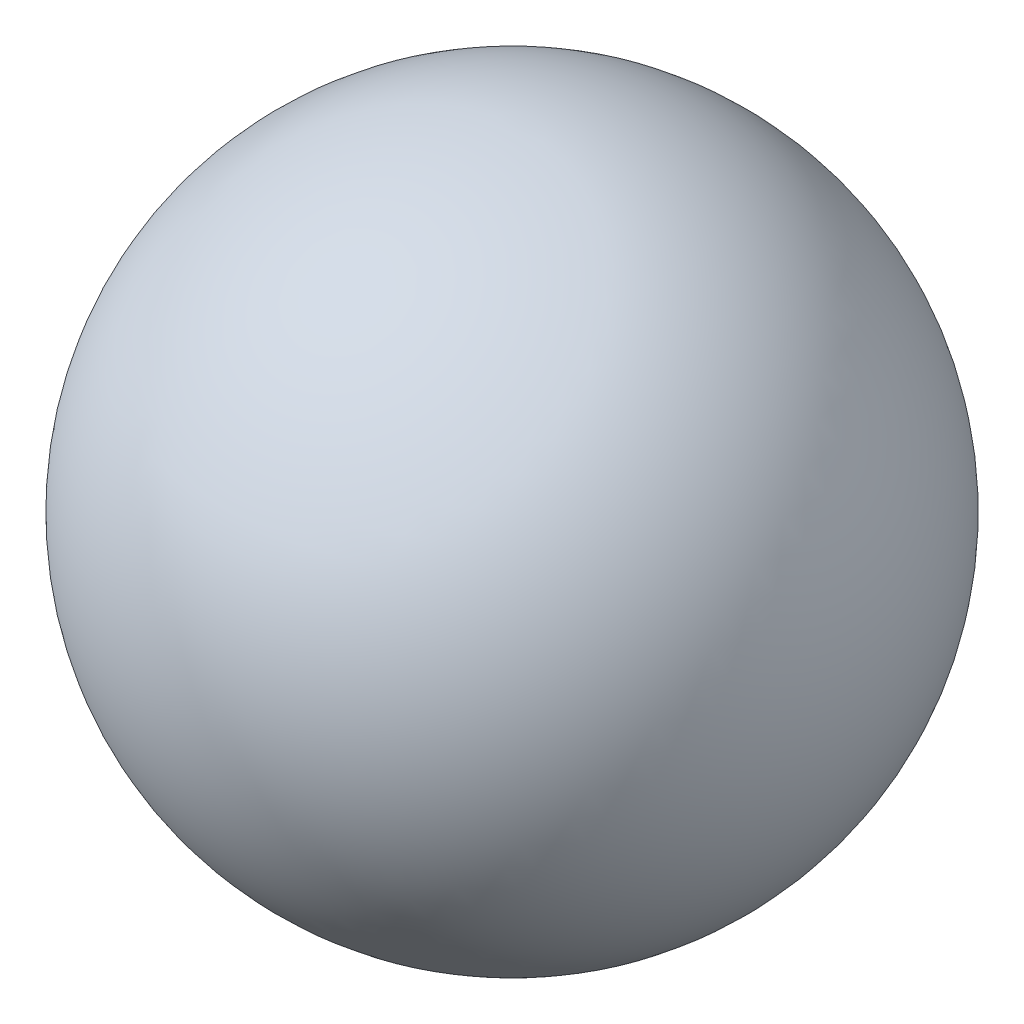
ISO-10303-21;
HEADER;
FILE_DESCRIPTION(('STEP AP214'),'2;1');
FILE_NAME('part.step','',(''),(''),'','','');
FILE_SCHEMA(('AUTOMOTIVE_DESIGN { 1 0 10303 214 1 1 1 1 }'));
ENDSEC;
DATA;
#1=APPLICATION_CONTEXT('core data for automotive mechanical design processes');
#2=APPLICATION_PROTOCOL_DEFINITION('international standard','automotive_design',2000,#1);
#3=PRODUCT_CONTEXT('',#1,'mechanical');
#4=PRODUCT('Part','Part','',(#3));
#5=PRODUCT_RELATED_PRODUCT_CATEGORY('part','',(#4));
#6=PRODUCT_DEFINITION_FORMATION('','',#4);
#7=PRODUCT_DEFINITION_CONTEXT('part definition',#1,'design');
#8=PRODUCT_DEFINITION('design','',#6,#7);
#9=PRODUCT_DEFINITION_SHAPE('','',#8);
#10=(LENGTH_UNIT() NAMED_UNIT(*) SI_UNIT(.MILLI.,.METRE.));
#11=(NAMED_UNIT(*) PLANE_ANGLE_UNIT() SI_UNIT($,.RADIAN.));
#12=(NAMED_UNIT(*) SI_UNIT($,.STERADIAN.) SOLID_ANGLE_UNIT());
#13=UNCERTAINTY_MEASURE_WITH_UNIT(LENGTH_MEASURE(1.E-05),#10,'distance_accuracy_value','');
#14=(GEOMETRIC_REPRESENTATION_CONTEXT(3) GLOBAL_UNCERTAINTY_ASSIGNED_CONTEXT((#13)) GLOBAL_UNIT_ASSIGNED_CONTEXT((#10,
#11,#12)) REPRESENTATION_CONTEXT('',''));
#15=CARTESIAN_POINT('',(0.,0.,0.));
#16=DIRECTION('',(0.,0.,1.));
#17=DIRECTION('',(1.,0.,0.));
#18=AXIS2_PLACEMENT_3D('',#15,#16,#17);
#19=CARTESIAN_POINT('',(0.,0.,0.));
#20=DIRECTION('',(0.,1.,0.));
#21=DIRECTION('',(1.,0.,0.));
#22=AXIS2_PLACEMENT_3D('',#19,#20,#21);
#23=SPHERICAL_SURFACE('',#22,21.5);
#24=CARTESIAN_POINT('',(0.,21.5,0.));
#25=VERTEX_POINT('',#24);
#26=VERTEX_LOOP('',#25);
#27=FACE_BOUND('',#26,.T.);
#28=ADVANCED_FACE('F33',(#27),#23,.T.);
#29=CLOSED_SHELL('',(#28));
#30=MANIFOLD_SOLID_BREP('B2',#29);
#31=ADVANCED_BREP_SHAPE_REPRESENTATION('',(#18,#30),#14);
#32=SHAPE_DEFINITION_REPRESENTATION(#9,#31);
ENDSEC;
END-ISO-10303-21;
